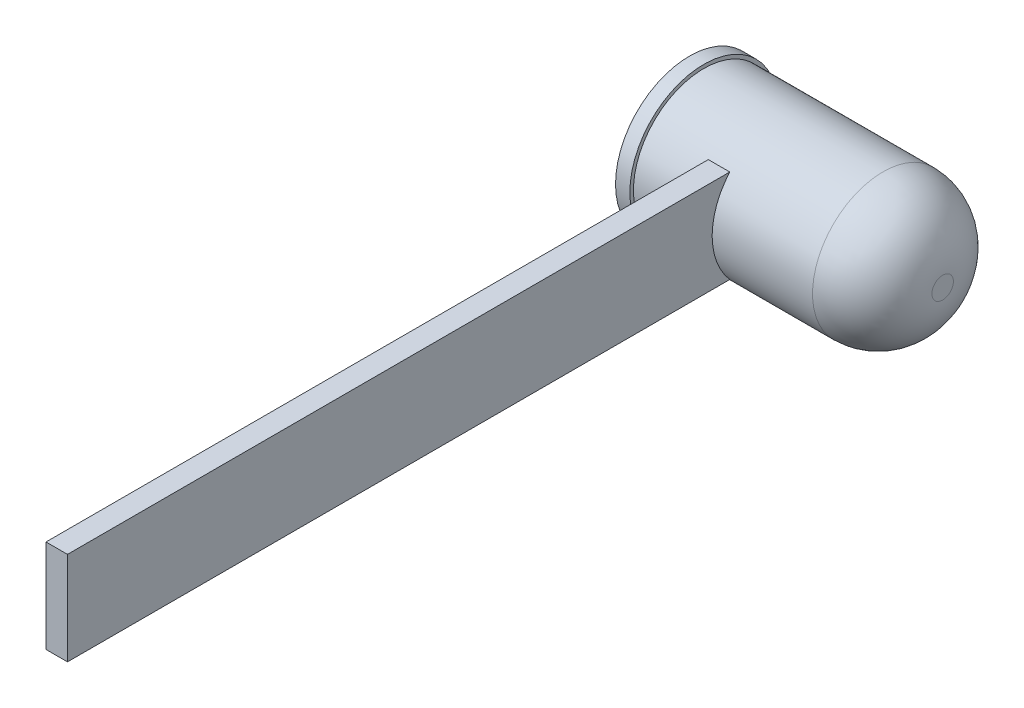
ISO-10303-21;
HEADER;
FILE_DESCRIPTION(('STEP AP214'),'2;1');
FILE_NAME('part.step','',(''),(''),'','','');
FILE_SCHEMA(('AUTOMOTIVE_DESIGN { 1 0 10303 214 1 1 1 1 }'));
ENDSEC;
DATA;
#1=APPLICATION_CONTEXT('core data for automotive mechanical design processes');
#2=APPLICATION_PROTOCOL_DEFINITION('international standard','automotive_design',2000,#1);
#3=PRODUCT_CONTEXT('',#1,'mechanical');
#4=PRODUCT('Part','Part','',(#3));
#5=PRODUCT_RELATED_PRODUCT_CATEGORY('part','',(#4));
#6=PRODUCT_DEFINITION_FORMATION('','',#4);
#7=PRODUCT_DEFINITION_CONTEXT('part definition',#1,'design');
#8=PRODUCT_DEFINITION('design','',#6,#7);
#9=PRODUCT_DEFINITION_SHAPE('','',#8);
#10=(LENGTH_UNIT() NAMED_UNIT(*) SI_UNIT(.MILLI.,.METRE.));
#11=(NAMED_UNIT(*) PLANE_ANGLE_UNIT() SI_UNIT($,.RADIAN.));
#12=(NAMED_UNIT(*) SI_UNIT($,.STERADIAN.) SOLID_ANGLE_UNIT());
#13=UNCERTAINTY_MEASURE_WITH_UNIT(LENGTH_MEASURE(1.E-05),#10,'distance_accuracy_value','');
#14=(GEOMETRIC_REPRESENTATION_CONTEXT(3) GLOBAL_UNCERTAINTY_ASSIGNED_CONTEXT((#13)) GLOBAL_UNIT_ASSIGNED_CONTEXT((#10,
#11,#12)) REPRESENTATION_CONTEXT('',''));
#15=CARTESIAN_POINT('',(0.,0.,0.));
#16=DIRECTION('',(0.,0.,1.));
#17=DIRECTION('',(1.,0.,0.));
#18=AXIS2_PLACEMENT_3D('',#15,#16,#17);
#19=CARTESIAN_POINT('',(10.,0.,0.));
#20=DIRECTION('',(-1.,0.,0.));
#21=DIRECTION('',(0.,0.,1.));
#22=AXIS2_PLACEMENT_3D('',#19,#20,#21);
#23=CYLINDRICAL_SURFACE('',#22,2.95);
#24=CARTESIAN_POINT('',(7.5,0.,0.));
#25=DIRECTION('',(1.,0.,0.));
#26=DIRECTION('',(0.,0.,-1.));
#27=AXIS2_PLACEMENT_3D('',#24,#25,#26);
#28=CIRCLE('',#27,2.95);
#29=CARTESIAN_POINT('',(7.5,0.,-2.95));
#30=VERTEX_POINT('',#29);
#31=EDGE_CURVE('E102',#30,#30,#28,.F.);
#32=ORIENTED_EDGE('',*,*,#31,.T.);
#33=EDGE_LOOP('',(#32));
#34=FACE_BOUND('',#33,.T.);
#35=CARTESIAN_POINT('',(0.,0.,0.));
#36=DIRECTION('',(1.,0.,0.));
#37=DIRECTION('',(0.,0.,-1.));
#38=AXIS2_PLACEMENT_3D('',#35,#36,#37);
#39=CIRCLE('',#38,2.95);
#40=CARTESIAN_POINT('',(0.,0.,-2.95));
#41=VERTEX_POINT('',#40);
#42=EDGE_CURVE('E144',#41,#41,#39,.T.);
#43=ORIENTED_EDGE('',*,*,#42,.T.);
#44=EDGE_LOOP('',(#43));
#45=FACE_BOUND('',#44,.T.);
#46=CARTESIAN_POINT('',(2.39870790291138,0.,0.));
#47=DIRECTION('',(1.,0.,0.));
#48=DIRECTION('',(0.,0.,-1.));
#49=AXIS2_PLACEMENT_3D('',#46,#47,#48);
#50=CIRCLE('',#49,2.95);
#51=CARTESIAN_POINT('',(2.39870790291138,1.95000000000002,2.21359436211785));
#52=VERTEX_POINT('',#51);
#53=CARTESIAN_POINT('',(2.39870790291138,0.0625621200523241,2.9493365323636));
#54=VERTEX_POINT('',#53);
#55=EDGE_CURVE('E53',#52,#54,#50,.T.);
#56=ORIENTED_EDGE('',*,*,#55,.F.);
#57=DIRECTION('',(-1.,0.,0.));
#58=VECTOR('',#57,1.);
#59=CARTESIAN_POINT('',(10.,1.95000000000002,2.21359436211785));
#60=LINE('',#59,#58);
#61=CARTESIAN_POINT('',(3.29870790291138,1.95000000000002,2.21359436211785));
#62=VERTEX_POINT('',#61);
#63=EDGE_CURVE('E303',#62,#52,#60,.T.);
#64=ORIENTED_EDGE('',*,*,#63,.F.);
#65=CARTESIAN_POINT('',(3.29870790291138,0.,0.));
#66=DIRECTION('',(-1.,0.,0.));
#67=DIRECTION('',(0.,-1.,0.));
#68=AXIS2_PLACEMENT_3D('',#65,#66,#67);
#69=CIRCLE('',#68,2.95);
#70=CARTESIAN_POINT('',(3.29870790291138,0.0625621200523241,2.9493365323636));
#71=VERTEX_POINT('',#70);
#72=EDGE_CURVE('E296',#71,#62,#69,.T.);
#73=ORIENTED_EDGE('',*,*,#72,.F.);
#74=CARTESIAN_POINT('',(3.29870790291138,-0.0625621200523246,2.9493365323636));
#75=CARTESIAN_POINT('',(3.29870790291138,0.,2.95066361688668));
#76=CARTESIAN_POINT('',(3.29870790291138,0.0625621200523241,2.9493365323636));
#77=B_SPLINE_CURVE_WITH_KNOTS('',2,(#74,#75,#76),.UNSPECIFIED.,.F.,.F.,(3,3),(0.,1.),.UNSPECIFIED.);
#78=CARTESIAN_POINT('',(3.29870790291138,-0.0625621200523244,2.9493365323636));
#79=VERTEX_POINT('',#78);
#80=EDGE_CURVE('E11',#79,#71,#77,.T.);
#81=ORIENTED_EDGE('',*,*,#80,.F.);
#82=CARTESIAN_POINT('',(3.29870790291138,-1.94999999999998,2.21359436211789));
#83=VERTEX_POINT('',#82);
#84=EDGE_CURVE('E298',#83,#79,#69,.T.);
#85=ORIENTED_EDGE('',*,*,#84,.F.);
#86=DIRECTION('',(-1.,0.,0.));
#87=VECTOR('',#86,1.);
#88=CARTESIAN_POINT('',(10.,-1.94999999999998,2.21359436211789));
#89=LINE('',#88,#87);
#90=CARTESIAN_POINT('',(2.39870790291138,-1.94999999999998,2.21359436211789));
#91=VERTEX_POINT('',#90);
#92=EDGE_CURVE('E97',#91,#83,#89,.F.);
#93=ORIENTED_EDGE('',*,*,#92,.F.);
#94=CARTESIAN_POINT('',(2.39870790291138,-0.0625621200523241,2.9493365323636));
#95=VERTEX_POINT('',#94);
#96=EDGE_CURVE('E93',#95,#91,#50,.T.);
#97=ORIENTED_EDGE('',*,*,#96,.F.);
#98=CARTESIAN_POINT('',(2.39870790291138,0.0625621200523246,2.9493365323636));
#99=CARTESIAN_POINT('',(2.39870790291138,0.,2.95066361688668));
#100=CARTESIAN_POINT('',(2.39870790291138,-0.0625621200523241,2.9493365323636));
#101=B_SPLINE_CURVE_WITH_KNOTS('',2,(#98,#99,#100),.UNSPECIFIED.,.F.,.F.,(3,3),(0.,1.),.UNSPECIFIED.);
#102=EDGE_CURVE('E46',#54,#95,#101,.T.);
#103=ORIENTED_EDGE('',*,*,#102,.F.);
#104=EDGE_LOOP('',(#56,#64,#73,#81,#85,#93,#97,#103));
#105=FACE_BOUND('',#104,.T.);
#106=ADVANCED_FACE('F36',(#34,#45,#105),#23,.T.);
#107=CARTESIAN_POINT('',(10.,0.,0.));
#108=DIRECTION('',(1.,0.,0.));
#109=DIRECTION('',(0.,0.,-1.));
#110=AXIS2_PLACEMENT_3D('',#107,#108,#109);
#111=PLANE('',#110);
#112=CARTESIAN_POINT('',(10.,0.,0.));
#113=DIRECTION('',(1.,0.,0.));
#114=DIRECTION('',(0.,0.,-1.));
#115=AXIS2_PLACEMENT_3D('',#112,#113,#114);
#116=CIRCLE('',#115,0.450000000000001);
#117=CARTESIAN_POINT('',(10.,0.,-0.450000000000001));
#118=VERTEX_POINT('',#117);
#119=EDGE_CURVE('E150',#118,#118,#116,.T.);
#120=ORIENTED_EDGE('',*,*,#119,.T.);
#121=EDGE_LOOP('',(#120));
#122=FACE_BOUND('',#121,.T.);
#123=ADVANCED_FACE('F166',(#122),#111,.T.);
#124=CARTESIAN_POINT('',(7.5,0.,0.));
#125=DIRECTION('',(1.,0.,0.));
#126=DIRECTION('',(0.,0.,-1.));
#127=AXIS2_PLACEMENT_3D('',#124,#125,#126);
#128=DEGENERATE_TOROIDAL_SURFACE('',#127,0.450000000000001,2.5,.T.);
#129=ORIENTED_EDGE('',*,*,#31,.F.);
#130=EDGE_LOOP('',(#129));
#131=FACE_BOUND('',#130,.T.);
#132=ORIENTED_EDGE('',*,*,#119,.F.);
#133=EDGE_LOOP('',(#132));
#134=FACE_BOUND('',#133,.T.);
#135=ADVANCED_FACE('F38',(#131,#134),#128,.T.);
#136=CARTESIAN_POINT('',(-0.6,0.,0.));
#137=DIRECTION('',(1.,0.,0.));
#138=DIRECTION('',(0.,0.,-1.));
#139=AXIS2_PLACEMENT_3D('',#136,#137,#138);
#140=CYLINDRICAL_SURFACE('',#139,3.1);
#141=CARTESIAN_POINT('',(-0.6,0.,0.));
#142=DIRECTION('',(-1.,0.,0.));
#143=DIRECTION('',(0.,0.,1.));
#144=AXIS2_PLACEMENT_3D('',#141,#142,#143);
#145=CIRCLE('',#144,3.1);
#146=CARTESIAN_POINT('',(-0.6,0.,3.1));
#147=VERTEX_POINT('',#146);
#148=EDGE_CURVE('E136',#147,#147,#145,.T.);
#149=ORIENTED_EDGE('',*,*,#148,.F.);
#150=EDGE_LOOP('',(#149));
#151=FACE_BOUND('',#150,.T.);
#152=CARTESIAN_POINT('',(0.,0.,0.));
#153=DIRECTION('',(-1.,0.,0.));
#154=DIRECTION('',(0.,0.,1.));
#155=AXIS2_PLACEMENT_3D('',#152,#153,#154);
#156=CIRCLE('',#155,3.1);
#157=CARTESIAN_POINT('',(0.,0.,3.1));
#158=VERTEX_POINT('',#157);
#159=EDGE_CURVE('E145',#158,#158,#156,.T.);
#160=ORIENTED_EDGE('',*,*,#159,.T.);
#161=EDGE_LOOP('',(#160));
#162=FACE_BOUND('',#161,.T.);
#163=ADVANCED_FACE('F172',(#151,#162),#140,.T.);
#164=CARTESIAN_POINT('',(-0.6,0.,0.));
#165=DIRECTION('',(-1.,0.,0.));
#166=DIRECTION('',(0.,0.,1.));
#167=AXIS2_PLACEMENT_3D('',#164,#165,#166);
#168=PLANE('',#167);
#169=ORIENTED_EDGE('',*,*,#148,.T.);
#170=EDGE_LOOP('',(#169));
#171=FACE_BOUND('',#170,.T.);
#172=ADVANCED_FACE('F175',(#171),#168,.T.);
#173=CARTESIAN_POINT('',(0.,0.,0.));
#174=DIRECTION('',(-1.,0.,0.));
#175=DIRECTION('',(0.,0.,1.));
#176=AXIS2_PLACEMENT_3D('',#173,#174,#175);
#177=PLANE('',#176);
#178=ORIENTED_EDGE('',*,*,#42,.F.);
#179=EDGE_LOOP('',(#178));
#180=FACE_BOUND('',#179,.T.);
#181=ORIENTED_EDGE('',*,*,#159,.F.);
#182=EDGE_LOOP('',(#181));
#183=FACE_BOUND('',#182,.T.);
#184=ADVANCED_FACE('F177',(#180,#183),#177,.F.);
#185=CARTESIAN_POINT('',(3.29870790291138,-1.94999999999998,29.9493365323636));
#186=DIRECTION('',(0.,1.,0.));
#187=DIRECTION('',(0.,0.,1.));
#188=AXIS2_PLACEMENT_3D('',#185,#186,#187);
#189=PLANE('',#188);
#190=DIRECTION('',(0.,0.,-1.));
#191=VECTOR('',#190,1.);
#192=CARTESIAN_POINT('',(2.39870790291138,-1.94999999999998,29.9493365323636));
#193=LINE('',#192,#191);
#194=CARTESIAN_POINT('',(2.39870790291138,-1.94999999999998,29.9493365323636));
#195=VERTEX_POINT('',#194);
#196=EDGE_CURVE('E284',#195,#91,#193,.T.);
#197=ORIENTED_EDGE('',*,*,#196,.T.);
#198=ORIENTED_EDGE('',*,*,#92,.T.);
#199=DIRECTION('',(0.,0.,-1.));
#200=VECTOR('',#199,1.);
#201=CARTESIAN_POINT('',(3.29870790291138,-1.94999999999998,29.9493365323636));
#202=LINE('',#201,#200);
#203=CARTESIAN_POINT('',(3.29870790291138,-1.94999999999998,29.9493365323636));
#204=VERTEX_POINT('',#203);
#205=EDGE_CURVE('E105',#204,#83,#202,.T.);
#206=ORIENTED_EDGE('',*,*,#205,.F.);
#207=DIRECTION('',(1.,0.,0.));
#208=VECTOR('',#207,1.);
#209=CARTESIAN_POINT('',(3.29870790291138,-1.94999999999998,29.9493365323636));
#210=LINE('',#209,#208);
#211=EDGE_CURVE('E98',#195,#204,#210,.T.);
#212=ORIENTED_EDGE('',*,*,#211,.F.);
#213=EDGE_LOOP('',(#197,#198,#206,#212));
#214=FACE_BOUND('',#213,.T.);
#215=ADVANCED_FACE('F130',(#214),#189,.F.);
#216=CARTESIAN_POINT('',(3.29870790291138,1.95000000000002,29.9493365323636));
#217=DIRECTION('',(-1.,0.,0.));
#218=DIRECTION('',(0.,-1.,0.));
#219=AXIS2_PLACEMENT_3D('',#216,#217,#218);
#220=PLANE('',#219);
#221=ORIENTED_EDGE('',*,*,#205,.T.);
#222=ORIENTED_EDGE('',*,*,#84,.T.);
#223=ORIENTED_EDGE('',*,*,#80,.T.);
#224=ORIENTED_EDGE('',*,*,#72,.T.);
#225=DIRECTION('',(0.,0.,-1.));
#226=VECTOR('',#225,1.);
#227=CARTESIAN_POINT('',(3.29870790291138,1.95000000000002,29.9493365323636));
#228=LINE('',#227,#226);
#229=CARTESIAN_POINT('',(3.29870790291138,1.95000000000002,29.9493365323636));
#230=VERTEX_POINT('',#229);
#231=EDGE_CURVE('E279',#230,#62,#228,.T.);
#232=ORIENTED_EDGE('',*,*,#231,.F.);
#233=DIRECTION('',(0.,1.,0.));
#234=VECTOR('',#233,1.);
#235=CARTESIAN_POINT('',(3.29870790291138,1.95000000000002,29.9493365323636));
#236=LINE('',#235,#234);
#237=EDGE_CURVE('E276',#204,#230,#236,.T.);
#238=ORIENTED_EDGE('',*,*,#237,.F.);
#239=EDGE_LOOP('',(#221,#222,#223,#224,#232,#238));
#240=FACE_BOUND('',#239,.T.);
#241=ADVANCED_FACE('F125',(#240),#220,.F.);
#242=CARTESIAN_POINT('',(2.39870790291138,1.95000000000002,29.9493365323636));
#243=DIRECTION('',(0.,-1.,0.));
#244=DIRECTION('',(0.,0.,-1.));
#245=AXIS2_PLACEMENT_3D('',#242,#243,#244);
#246=PLANE('',#245);
#247=ORIENTED_EDGE('',*,*,#231,.T.);
#248=ORIENTED_EDGE('',*,*,#63,.T.);
#249=DIRECTION('',(0.,0.,-1.));
#250=VECTOR('',#249,1.);
#251=CARTESIAN_POINT('',(2.39870790291138,1.95000000000002,29.9493365323636));
#252=LINE('',#251,#250);
#253=CARTESIAN_POINT('',(2.39870790291138,1.95000000000002,29.9493365323636));
#254=VERTEX_POINT('',#253);
#255=EDGE_CURVE('E280',#254,#52,#252,.T.);
#256=ORIENTED_EDGE('',*,*,#255,.F.);
#257=DIRECTION('',(-1.,0.,0.));
#258=VECTOR('',#257,1.);
#259=CARTESIAN_POINT('',(2.39870790291138,1.95000000000002,29.9493365323636));
#260=LINE('',#259,#258);
#261=EDGE_CURVE('E289',#230,#254,#260,.T.);
#262=ORIENTED_EDGE('',*,*,#261,.F.);
#263=EDGE_LOOP('',(#247,#248,#256,#262));
#264=FACE_BOUND('',#263,.T.);
#265=ADVANCED_FACE('F122',(#264),#246,.F.);
#266=CARTESIAN_POINT('',(2.39870790291138,-1.94999999999998,29.9493365323636));
#267=DIRECTION('',(1.,0.,0.));
#268=DIRECTION('',(0.,1.,0.));
#269=AXIS2_PLACEMENT_3D('',#266,#267,#268);
#270=PLANE('',#269);
#271=ORIENTED_EDGE('',*,*,#255,.T.);
#272=ORIENTED_EDGE('',*,*,#55,.T.);
#273=ORIENTED_EDGE('',*,*,#102,.T.);
#274=ORIENTED_EDGE('',*,*,#96,.T.);
#275=ORIENTED_EDGE('',*,*,#196,.F.);
#276=DIRECTION('',(0.,-1.,0.));
#277=VECTOR('',#276,1.);
#278=CARTESIAN_POINT('',(2.39870790291138,-1.94999999999998,29.9493365323636));
#279=LINE('',#278,#277);
#280=EDGE_CURVE('E61',#254,#195,#279,.T.);
#281=ORIENTED_EDGE('',*,*,#280,.F.);
#282=EDGE_LOOP('',(#271,#272,#273,#274,#275,#281));
#283=FACE_BOUND('',#282,.T.);
#284=ADVANCED_FACE('F101',(#283),#270,.F.);
#285=CARTESIAN_POINT('',(0.,0.,29.9493365323636));
#286=DIRECTION('',(0.,0.,-1.));
#287=DIRECTION('',(-1.,0.,0.));
#288=AXIS2_PLACEMENT_3D('',#285,#286,#287);
#289=PLANE('',#288);
#290=ORIENTED_EDGE('',*,*,#211,.T.);
#291=ORIENTED_EDGE('',*,*,#237,.T.);
#292=ORIENTED_EDGE('',*,*,#261,.T.);
#293=ORIENTED_EDGE('',*,*,#280,.T.);
#294=EDGE_LOOP('',(#290,#291,#292,#293));
#295=FACE_BOUND('',#294,.T.);
#296=ADVANCED_FACE('F121',(#295),#289,.F.);
#297=CLOSED_SHELL('',(#106,#123,#135,#163,#172,#184,#215,#241,#265,#284,#296));
#298=MANIFOLD_SOLID_BREP('B2',#297);
#299=ADVANCED_BREP_SHAPE_REPRESENTATION('',(#18,#298),#14);
#300=SHAPE_DEFINITION_REPRESENTATION(#9,#299);
ENDSEC;
END-ISO-10303-21;
